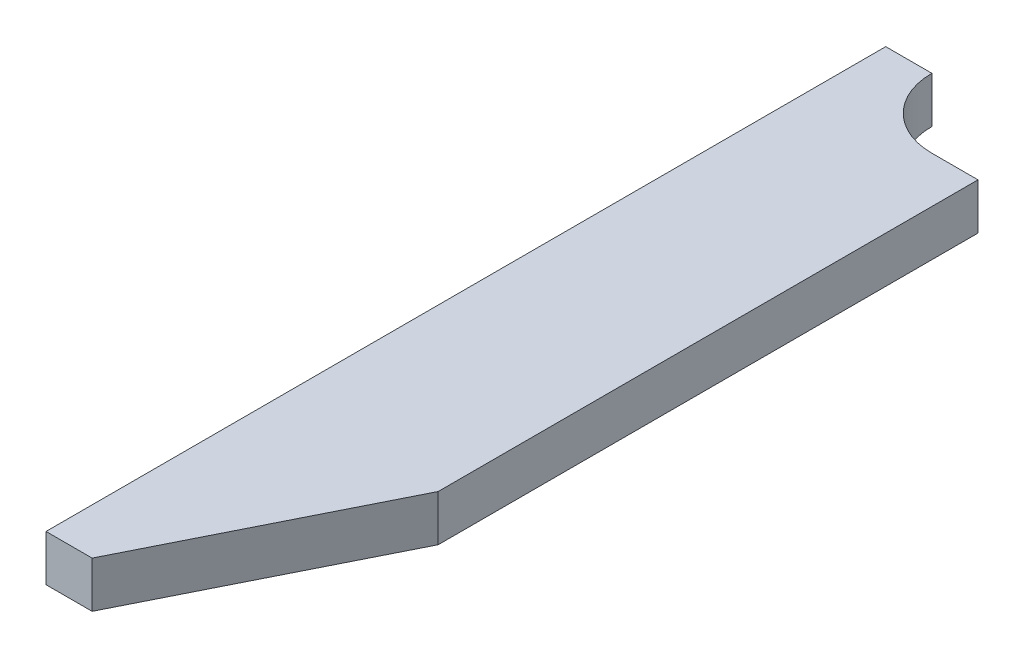
ISO-10303-21;
HEADER;
FILE_DESCRIPTION(('STEP AP214'),'2;1');
FILE_NAME('part.step','',(''),(''),'','','');
FILE_SCHEMA(('AUTOMOTIVE_DESIGN { 1 0 10303 214 1 1 1 1 }'));
ENDSEC;
DATA;
#1=APPLICATION_CONTEXT('core data for automotive mechanical design processes');
#2=APPLICATION_PROTOCOL_DEFINITION('international standard','automotive_design',2000,#1);
#3=PRODUCT_CONTEXT('',#1,'mechanical');
#4=PRODUCT('Part','Part','',(#3));
#5=PRODUCT_RELATED_PRODUCT_CATEGORY('part','',(#4));
#6=PRODUCT_DEFINITION_FORMATION('','',#4);
#7=PRODUCT_DEFINITION_CONTEXT('part definition',#1,'design');
#8=PRODUCT_DEFINITION('design','',#6,#7);
#9=PRODUCT_DEFINITION_SHAPE('','',#8);
#10=(LENGTH_UNIT() NAMED_UNIT(*) SI_UNIT(.MILLI.,.METRE.));
#11=(NAMED_UNIT(*) PLANE_ANGLE_UNIT() SI_UNIT($,.RADIAN.));
#12=(NAMED_UNIT(*) SI_UNIT($,.STERADIAN.) SOLID_ANGLE_UNIT());
#13=UNCERTAINTY_MEASURE_WITH_UNIT(LENGTH_MEASURE(1.E-05),#10,'distance_accuracy_value','');
#14=(GEOMETRIC_REPRESENTATION_CONTEXT(3) GLOBAL_UNCERTAINTY_ASSIGNED_CONTEXT((#13)) GLOBAL_UNIT_ASSIGNED_CONTEXT((#10,
#11,#12)) REPRESENTATION_CONTEXT('',''));
#15=CARTESIAN_POINT('',(0.,0.,0.));
#16=DIRECTION('',(0.,0.,1.));
#17=DIRECTION('',(1.,0.,0.));
#18=AXIS2_PLACEMENT_3D('',#15,#16,#17);
#19=CARTESIAN_POINT('',(3.195,1.77999999999,1.255));
#20=DIRECTION('',(0.,-1.,0.));
#21=DIRECTION('',(1.,0.,0.));
#22=AXIS2_PLACEMENT_3D('',#19,#20,#21);
#23=PLANE('',#22);
#24=DIRECTION('',(-0.447213595499958,0.,0.894427190999916));
#25=VECTOR('',#24,1.);
#26=CARTESIAN_POINT('',(3.295,1.77999999999,2.575));
#27=LINE('',#26,#25);
#28=CARTESIAN_POINT('',(3.295,1.77999999999,2.575));
#29=VERTEX_POINT('',#28);
#30=CARTESIAN_POINT('',(3.045,1.77999999999,3.075));
#31=VERTEX_POINT('',#30);
#32=EDGE_CURVE('E97',#29,#31,#27,.T.);
#33=ORIENTED_EDGE('',*,*,#32,.F.);
#34=DIRECTION('',(0.,0.,1.));
#35=VECTOR('',#34,1.);
#36=CARTESIAN_POINT('',(3.295,1.77999999999,1.255));
#37=LINE('',#36,#35);
#38=CARTESIAN_POINT('',(3.295,1.77999999999,1.405));
#39=VERTEX_POINT('',#38);
#40=EDGE_CURVE('E95',#39,#29,#37,.T.);
#41=ORIENTED_EDGE('',*,*,#40,.F.);
#42=DIRECTION('',(1.,0.,0.));
#43=VECTOR('',#42,1.);
#44=CARTESIAN_POINT('',(3.195,1.77999999999,1.405));
#45=LINE('',#44,#43);
#46=CARTESIAN_POINT('',(3.195,1.77999999999,1.405));
#47=VERTEX_POINT('',#46);
#48=EDGE_CURVE('E84',#47,#39,#45,.T.);
#49=ORIENTED_EDGE('',*,*,#48,.F.);
#50=CARTESIAN_POINT('',(3.195,1.77999999999,1.255));
#51=DIRECTION('',(0.,1.,0.));
#52=DIRECTION('',(-1.,0.,0.));
#53=AXIS2_PLACEMENT_3D('',#50,#51,#52);
#54=CIRCLE('',#53,0.15);
#55=CARTESIAN_POINT('',(3.045,1.77999999999,1.255));
#56=VERTEX_POINT('',#55);
#57=EDGE_CURVE('E19',#56,#47,#54,.T.);
#58=ORIENTED_EDGE('',*,*,#57,.F.);
#59=DIRECTION('',(1.,0.,0.));
#60=VECTOR('',#59,1.);
#61=CARTESIAN_POINT('',(3.195,1.77999999999,1.255));
#62=LINE('',#61,#60);
#63=CARTESIAN_POINT('',(2.945,1.77999999999,1.255));
#64=VERTEX_POINT('',#63);
#65=EDGE_CURVE('E71',#64,#56,#62,.T.);
#66=ORIENTED_EDGE('',*,*,#65,.F.);
#67=DIRECTION('',(0.,0.,1.));
#68=VECTOR('',#67,1.);
#69=CARTESIAN_POINT('',(2.945,1.77999999999,3.075));
#70=LINE('',#69,#68);
#71=CARTESIAN_POINT('',(2.945,1.77999999999,3.075));
#72=VERTEX_POINT('',#71);
#73=EDGE_CURVE('E143',#64,#72,#70,.T.);
#74=ORIENTED_EDGE('',*,*,#73,.T.);
#75=DIRECTION('',(-1.,0.,0.));
#76=VECTOR('',#75,1.);
#77=CARTESIAN_POINT('',(3.045,1.77999999999,3.075));
#78=LINE('',#77,#76);
#79=EDGE_CURVE('E109',#72,#31,#78,.F.);
#80=ORIENTED_EDGE('',*,*,#79,.T.);
#81=EDGE_LOOP('',(#33,#41,#49,#58,#66,#74,#80));
#82=FACE_BOUND('',#81,.T.);
#83=ADVANCED_FACE('F16',(#82),#23,.F.);
#84=CARTESIAN_POINT('',(3.045,1.67999999999,3.075));
#85=DIRECTION('',(0.,0.,-1.));
#86=DIRECTION('',(-1.,0.,0.));
#87=AXIS2_PLACEMENT_3D('',#84,#85,#86);
#88=PLANE('',#87);
#89=DIRECTION('',(0.,1.,0.));
#90=VECTOR('',#89,1.);
#91=CARTESIAN_POINT('',(2.945,1.67999999999,3.075));
#92=LINE('',#91,#90);
#93=CARTESIAN_POINT('',(2.945,1.67999999999,3.075));
#94=VERTEX_POINT('',#93);
#95=EDGE_CURVE('E148',#72,#94,#92,.F.);
#96=ORIENTED_EDGE('',*,*,#95,.T.);
#97=DIRECTION('',(1.,0.,0.));
#98=VECTOR('',#97,1.);
#99=CARTESIAN_POINT('',(3.195,1.67999999999,3.075));
#100=LINE('',#99,#98);
#101=CARTESIAN_POINT('',(3.045,1.67999999999,3.075));
#102=VERTEX_POINT('',#101);
#103=EDGE_CURVE('E126',#102,#94,#100,.F.);
#104=ORIENTED_EDGE('',*,*,#103,.F.);
#105=DIRECTION('',(0.,1.,0.));
#106=VECTOR('',#105,1.);
#107=CARTESIAN_POINT('',(3.045,1.67999999999,3.075));
#108=LINE('',#107,#106);
#109=EDGE_CURVE('E113',#102,#31,#108,.T.);
#110=ORIENTED_EDGE('',*,*,#109,.T.);
#111=ORIENTED_EDGE('',*,*,#79,.F.);
#112=EDGE_LOOP('',(#96,#104,#110,#111));
#113=FACE_BOUND('',#112,.T.);
#114=ADVANCED_FACE('F172',(#113),#88,.F.);
#115=CARTESIAN_POINT('',(2.945,1.67999999999,3.075));
#116=DIRECTION('',(1.,0.,0.));
#117=DIRECTION('',(0.,1.,0.));
#118=AXIS2_PLACEMENT_3D('',#115,#116,#117);
#119=PLANE('',#118);
#120=DIRECTION('',(0.,1.,0.));
#121=VECTOR('',#120,1.);
#122=CARTESIAN_POINT('',(2.945,1.67999999999,1.255));
#123=LINE('',#122,#121);
#124=CARTESIAN_POINT('',(2.945,1.67999999999,1.255));
#125=VERTEX_POINT('',#124);
#126=EDGE_CURVE('E141',#64,#125,#123,.F.);
#127=ORIENTED_EDGE('',*,*,#126,.T.);
#128=DIRECTION('',(0.,0.,1.));
#129=VECTOR('',#128,1.);
#130=CARTESIAN_POINT('',(2.945,1.67999999999,1.255));
#131=LINE('',#130,#129);
#132=EDGE_CURVE('E122',#94,#125,#131,.F.);
#133=ORIENTED_EDGE('',*,*,#132,.F.);
#134=ORIENTED_EDGE('',*,*,#95,.F.);
#135=ORIENTED_EDGE('',*,*,#73,.F.);
#136=EDGE_LOOP('',(#127,#133,#134,#135));
#137=FACE_BOUND('',#136,.T.);
#138=ADVANCED_FACE('F170',(#137),#119,.F.);
#139=CARTESIAN_POINT('',(2.945,1.67999999999,1.255));
#140=DIRECTION('',(0.,0.,1.));
#141=DIRECTION('',(1.,0.,0.));
#142=AXIS2_PLACEMENT_3D('',#139,#140,#141);
#143=PLANE('',#142);
#144=DIRECTION('',(0.,1.,0.));
#145=VECTOR('',#144,1.);
#146=CARTESIAN_POINT('',(3.045,1.67999999999,1.255));
#147=LINE('',#146,#145);
#148=CARTESIAN_POINT('',(3.045,1.67999999999,1.255));
#149=VERTEX_POINT('',#148);
#150=EDGE_CURVE('E81',#56,#149,#147,.F.);
#151=ORIENTED_EDGE('',*,*,#150,.T.);
#152=DIRECTION('',(1.,0.,0.));
#153=VECTOR('',#152,1.);
#154=CARTESIAN_POINT('',(3.195,1.67999999999,1.255));
#155=LINE('',#154,#153);
#156=EDGE_CURVE('E118',#125,#149,#155,.T.);
#157=ORIENTED_EDGE('',*,*,#156,.F.);
#158=ORIENTED_EDGE('',*,*,#126,.F.);
#159=ORIENTED_EDGE('',*,*,#65,.T.);
#160=EDGE_LOOP('',(#151,#157,#158,#159));
#161=FACE_BOUND('',#160,.T.);
#162=ADVANCED_FACE('F219',(#161),#143,.F.);
#163=CARTESIAN_POINT('',(3.195,1.67999999999,1.255));
#164=DIRECTION('',(0.,1.,0.));
#165=DIRECTION('',(-1.,0.,0.));
#166=AXIS2_PLACEMENT_3D('',#163,#164,#165);
#167=CYLINDRICAL_SURFACE('',#166,0.15);
#168=DIRECTION('',(0.,1.,0.));
#169=VECTOR('',#168,1.);
#170=CARTESIAN_POINT('',(3.195,1.67999999999,1.405));
#171=LINE('',#170,#169);
#172=CARTESIAN_POINT('',(3.195,1.67999999999,1.405));
#173=VERTEX_POINT('',#172);
#174=EDGE_CURVE('E79',#47,#173,#171,.F.);
#175=ORIENTED_EDGE('',*,*,#174,.T.);
#176=CARTESIAN_POINT('',(3.195,1.67999999999,1.255));
#177=DIRECTION('',(0.,1.,0.));
#178=DIRECTION('',(-1.,0.,0.));
#179=AXIS2_PLACEMENT_3D('',#176,#177,#178);
#180=CIRCLE('',#179,0.15);
#181=EDGE_CURVE('E117',#149,#173,#180,.T.);
#182=ORIENTED_EDGE('',*,*,#181,.F.);
#183=ORIENTED_EDGE('',*,*,#150,.F.);
#184=ORIENTED_EDGE('',*,*,#57,.T.);
#185=EDGE_LOOP('',(#175,#182,#183,#184));
#186=FACE_BOUND('',#185,.T.);
#187=ADVANCED_FACE('F77',(#186),#167,.F.);
#188=CARTESIAN_POINT('',(3.195,1.67999999999,1.405));
#189=DIRECTION('',(0.,0.,1.));
#190=DIRECTION('',(1.,0.,0.));
#191=AXIS2_PLACEMENT_3D('',#188,#189,#190);
#192=PLANE('',#191);
#193=DIRECTION('',(0.,-1.,0.));
#194=VECTOR('',#193,1.);
#195=CARTESIAN_POINT('',(3.295,1.67999999999,1.405));
#196=LINE('',#195,#194);
#197=CARTESIAN_POINT('',(3.295,1.67999999999,1.405));
#198=VERTEX_POINT('',#197);
#199=EDGE_CURVE('E91',#39,#198,#196,.T.);
#200=ORIENTED_EDGE('',*,*,#199,.T.);
#201=DIRECTION('',(1.,0.,0.));
#202=VECTOR('',#201,1.);
#203=CARTESIAN_POINT('',(3.195,1.67999999999,1.405));
#204=LINE('',#203,#202);
#205=EDGE_CURVE('E89',#173,#198,#204,.T.);
#206=ORIENTED_EDGE('',*,*,#205,.F.);
#207=ORIENTED_EDGE('',*,*,#174,.F.);
#208=ORIENTED_EDGE('',*,*,#48,.T.);
#209=EDGE_LOOP('',(#200,#206,#207,#208));
#210=FACE_BOUND('',#209,.T.);
#211=ADVANCED_FACE('F86',(#210),#192,.F.);
#212=CARTESIAN_POINT('',(3.295,1.67999999999,1.405));
#213=DIRECTION('',(-1.,0.,0.));
#214=DIRECTION('',(0.,-1.,0.));
#215=AXIS2_PLACEMENT_3D('',#212,#213,#214);
#216=PLANE('',#215);
#217=DIRECTION('',(0.,1.,0.));
#218=VECTOR('',#217,1.);
#219=CARTESIAN_POINT('',(3.295,1.67999999999,2.575));
#220=LINE('',#219,#218);
#221=CARTESIAN_POINT('',(3.295,1.67999999999,2.575));
#222=VERTEX_POINT('',#221);
#223=EDGE_CURVE('E34',#29,#222,#220,.F.);
#224=ORIENTED_EDGE('',*,*,#223,.T.);
#225=DIRECTION('',(0.,0.,1.));
#226=VECTOR('',#225,1.);
#227=CARTESIAN_POINT('',(3.295,1.67999999999,1.255));
#228=LINE('',#227,#226);
#229=EDGE_CURVE('E25',#198,#222,#228,.T.);
#230=ORIENTED_EDGE('',*,*,#229,.F.);
#231=ORIENTED_EDGE('',*,*,#199,.F.);
#232=ORIENTED_EDGE('',*,*,#40,.T.);
#233=EDGE_LOOP('',(#224,#230,#231,#232));
#234=FACE_BOUND('',#233,.T.);
#235=ADVANCED_FACE('F177',(#234),#216,.F.);
#236=CARTESIAN_POINT('',(3.295,1.67999999999,2.575));
#237=DIRECTION('',(-0.894427190999916,0.,-0.447213595499958));
#238=DIRECTION('',(-0.447213595499958,0.,0.894427190999916));
#239=AXIS2_PLACEMENT_3D('',#236,#237,#238);
#240=PLANE('',#239);
#241=ORIENTED_EDGE('',*,*,#109,.F.);
#242=DIRECTION('',(-0.447213595499958,0.,0.894427190999916));
#243=VECTOR('',#242,1.);
#244=CARTESIAN_POINT('',(3.295,1.67999999999,2.575));
#245=LINE('',#244,#243);
#246=EDGE_CURVE('E11',#222,#102,#245,.T.);
#247=ORIENTED_EDGE('',*,*,#246,.F.);
#248=ORIENTED_EDGE('',*,*,#223,.F.);
#249=ORIENTED_EDGE('',*,*,#32,.T.);
#250=EDGE_LOOP('',(#241,#247,#248,#249));
#251=FACE_BOUND('',#250,.T.);
#252=ADVANCED_FACE('F175',(#251),#240,.F.);
#253=CARTESIAN_POINT('',(3.195,1.67999999999,1.255));
#254=DIRECTION('',(0.,-1.,0.));
#255=DIRECTION('',(1.,0.,0.));
#256=AXIS2_PLACEMENT_3D('',#253,#254,#255);
#257=PLANE('',#256);
#258=ORIENTED_EDGE('',*,*,#229,.T.);
#259=ORIENTED_EDGE('',*,*,#246,.T.);
#260=ORIENTED_EDGE('',*,*,#103,.T.);
#261=ORIENTED_EDGE('',*,*,#132,.T.);
#262=ORIENTED_EDGE('',*,*,#156,.T.);
#263=ORIENTED_EDGE('',*,*,#181,.T.);
#264=ORIENTED_EDGE('',*,*,#205,.T.);
#265=EDGE_LOOP('',(#258,#259,#260,#261,#262,#263,#264));
#266=FACE_BOUND('',#265,.T.);
#267=ADVANCED_FACE('F176',(#266),#257,.T.);
#268=CLOSED_SHELL('',(#83,#114,#138,#162,#187,#211,#235,#252,#267));
#269=MANIFOLD_SOLID_BREP('B1',#268);
#270=ADVANCED_BREP_SHAPE_REPRESENTATION('',(#18,#269),#14);
#271=SHAPE_DEFINITION_REPRESENTATION(#9,#270);
ENDSEC;
END-ISO-10303-21;
